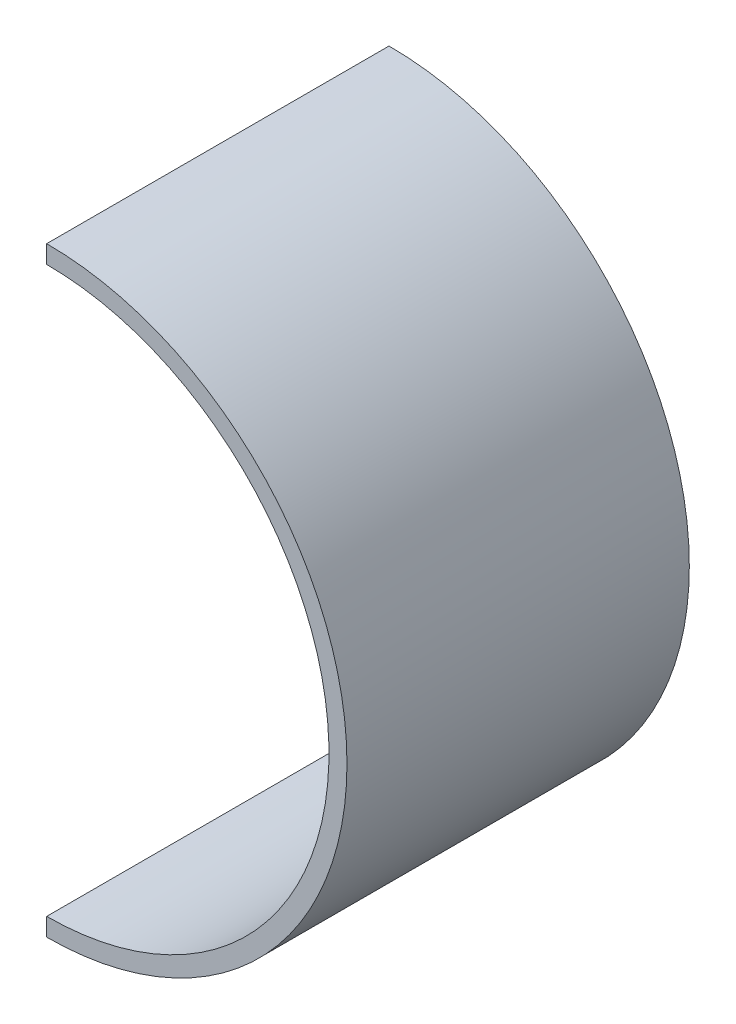
ISO-10303-21;
HEADER;
FILE_DESCRIPTION(('STEP AP214'),'2;1');
FILE_NAME('part.step','',(''),(''),'','','');
FILE_SCHEMA(('AUTOMOTIVE_DESIGN { 1 0 10303 214 1 1 1 1 }'));
ENDSEC;
DATA;
#1=APPLICATION_CONTEXT('core data for automotive mechanical design processes');
#2=APPLICATION_PROTOCOL_DEFINITION('international standard','automotive_design',2000,#1);
#3=PRODUCT_CONTEXT('',#1,'mechanical');
#4=PRODUCT('Part','Part','',(#3));
#5=PRODUCT_RELATED_PRODUCT_CATEGORY('part','',(#4));
#6=PRODUCT_DEFINITION_FORMATION('','',#4);
#7=PRODUCT_DEFINITION_CONTEXT('part definition',#1,'design');
#8=PRODUCT_DEFINITION('design','',#6,#7);
#9=PRODUCT_DEFINITION_SHAPE('','',#8);
#10=(LENGTH_UNIT() NAMED_UNIT(*) SI_UNIT(.MILLI.,.METRE.));
#11=(NAMED_UNIT(*) PLANE_ANGLE_UNIT() SI_UNIT($,.RADIAN.));
#12=(NAMED_UNIT(*) SI_UNIT($,.STERADIAN.) SOLID_ANGLE_UNIT());
#13=UNCERTAINTY_MEASURE_WITH_UNIT(LENGTH_MEASURE(1.E-05),#10,'distance_accuracy_value','');
#14=(GEOMETRIC_REPRESENTATION_CONTEXT(3) GLOBAL_UNCERTAINTY_ASSIGNED_CONTEXT((#13)) GLOBAL_UNIT_ASSIGNED_CONTEXT((#10,
#11,#12)) REPRESENTATION_CONTEXT('',''));
#15=CARTESIAN_POINT('',(0.,0.,0.));
#16=DIRECTION('',(0.,0.,1.));
#17=DIRECTION('',(1.,0.,0.));
#18=AXIS2_PLACEMENT_3D('',#15,#16,#17);
#19=CARTESIAN_POINT('',(-300.,0.,60.));
#20=DIRECTION('',(0.,0.,1.));
#21=DIRECTION('',(1.,0.,0.));
#22=AXIS2_PLACEMENT_3D('',#19,#20,#21);
#23=PLANE('',#22);
#24=CARTESIAN_POINT('',(300.,0.,60.));
#25=DIRECTION('',(0.,0.,1.));
#26=DIRECTION('',(1.,0.,0.));
#27=AXIS2_PLACEMENT_3D('',#24,#25,#26);
#28=CIRCLE('',#27,50.);
#29=CARTESIAN_POINT('',(300.,-50.,60.));
#30=VERTEX_POINT('',#29);
#31=CARTESIAN_POINT('',(300.,50.,60.));
#32=VERTEX_POINT('',#31);
#33=EDGE_CURVE('E91',#30,#32,#28,.T.);
#34=ORIENTED_EDGE('',*,*,#33,.T.);
#35=DIRECTION('',(0.,-1.,0.));
#36=VECTOR('',#35,1.);
#37=CARTESIAN_POINT('',(300.,3.43367945760358E-13,60.));
#38=LINE('',#37,#36);
#39=CARTESIAN_POINT('',(300.,47.,60.));
#40=VERTEX_POINT('',#39);
#41=EDGE_CURVE('E76',#32,#40,#38,.T.);
#42=ORIENTED_EDGE('',*,*,#41,.T.);
#43=CARTESIAN_POINT('',(300.,0.,60.));
#44=DIRECTION('',(0.,0.,1.));
#45=DIRECTION('',(1.,0.,0.));
#46=AXIS2_PLACEMENT_3D('',#43,#44,#45);
#47=CIRCLE('',#46,47.);
#48=CARTESIAN_POINT('',(300.,-47.,60.));
#49=VERTEX_POINT('',#48);
#50=EDGE_CURVE('E81',#49,#40,#47,.T.);
#51=ORIENTED_EDGE('',*,*,#50,.F.);
#52=EDGE_CURVE('E92',#49,#30,#38,.T.);
#53=ORIENTED_EDGE('',*,*,#52,.T.);
#54=EDGE_LOOP('',(#34,#42,#51,#53));
#55=FACE_BOUND('',#54,.T.);
#56=ADVANCED_FACE('F32',(#55),#23,.T.);
#57=CARTESIAN_POINT('',(0.,0.,3.));
#58=DIRECTION('',(0.,0.,1.));
#59=DIRECTION('',(1.,0.,0.));
#60=AXIS2_PLACEMENT_3D('',#57,#58,#59);
#61=PLANE('',#60);
#62=DIRECTION('',(0.,1.,0.));
#63=VECTOR('',#62,1.);
#64=CARTESIAN_POINT('',(300.,1.71683972880179E-13,3.));
#65=LINE('',#64,#63);
#66=CARTESIAN_POINT('',(300.,47.,3.));
#67=VERTEX_POINT('',#66);
#68=CARTESIAN_POINT('',(300.,50.,3.));
#69=VERTEX_POINT('',#68);
#70=EDGE_CURVE('E41',#67,#69,#65,.T.);
#71=ORIENTED_EDGE('',*,*,#70,.T.);
#72=CARTESIAN_POINT('',(300.,0.,3.));
#73=DIRECTION('',(0.,0.,1.));
#74=DIRECTION('',(1.,0.,0.));
#75=AXIS2_PLACEMENT_3D('',#72,#73,#74);
#76=CIRCLE('',#75,50.);
#77=CARTESIAN_POINT('',(300.,-50.,3.));
#78=VERTEX_POINT('',#77);
#79=EDGE_CURVE('E88',#78,#69,#76,.T.);
#80=ORIENTED_EDGE('',*,*,#79,.F.);
#81=DIRECTION('',(0.,1.,0.));
#82=VECTOR('',#81,1.);
#83=CARTESIAN_POINT('',(300.,1.71683972880179E-13,3.));
#84=LINE('',#83,#82);
#85=CARTESIAN_POINT('',(300.,-47.,3.));
#86=VERTEX_POINT('',#85);
#87=EDGE_CURVE('E11',#78,#86,#84,.T.);
#88=ORIENTED_EDGE('',*,*,#87,.T.);
#89=CARTESIAN_POINT('',(300.,0.,3.));
#90=DIRECTION('',(0.,0.,1.));
#91=DIRECTION('',(1.,0.,0.));
#92=AXIS2_PLACEMENT_3D('',#89,#90,#91);
#93=CIRCLE('',#92,47.);
#94=EDGE_CURVE('E36',#67,#86,#93,.F.);
#95=ORIENTED_EDGE('',*,*,#94,.F.);
#96=EDGE_LOOP('',(#71,#80,#88,#95));
#97=FACE_BOUND('',#96,.T.);
#98=ADVANCED_FACE('F34',(#97),#61,.F.);
#99=CARTESIAN_POINT('',(300.,0.,3.));
#100=DIRECTION('',(0.,0.,1.));
#101=DIRECTION('',(1.,0.,0.));
#102=AXIS2_PLACEMENT_3D('',#99,#100,#101);
#103=CYLINDRICAL_SURFACE('',#102,47.);
#104=DIRECTION('',(0.,0.,1.));
#105=VECTOR('',#104,1.);
#106=CARTESIAN_POINT('',(300.,47.,3.));
#107=LINE('',#106,#105);
#108=EDGE_CURVE('E71',#67,#40,#107,.T.);
#109=ORIENTED_EDGE('',*,*,#108,.F.);
#110=ORIENTED_EDGE('',*,*,#94,.T.);
#111=DIRECTION('',(0.,0.,1.));
#112=VECTOR('',#111,1.);
#113=CARTESIAN_POINT('',(300.,-47.,3.));
#114=LINE('',#113,#112);
#115=EDGE_CURVE('E84',#86,#49,#114,.T.);
#116=ORIENTED_EDGE('',*,*,#115,.T.);
#117=ORIENTED_EDGE('',*,*,#50,.T.);
#118=EDGE_LOOP('',(#109,#110,#116,#117));
#119=FACE_BOUND('',#118,.T.);
#120=ADVANCED_FACE('F82',(#119),#103,.F.);
#121=CARTESIAN_POINT('',(300.,0.,60.));
#122=DIRECTION('',(0.,0.,-1.));
#123=DIRECTION('',(-1.,0.,0.));
#124=AXIS2_PLACEMENT_3D('',#121,#122,#123);
#125=CYLINDRICAL_SURFACE('',#124,50.);
#126=DIRECTION('',(0.,0.,-1.));
#127=VECTOR('',#126,1.);
#128=CARTESIAN_POINT('',(300.,-50.,60.));
#129=LINE('',#128,#127);
#130=EDGE_CURVE('E94',#30,#78,#129,.T.);
#131=ORIENTED_EDGE('',*,*,#130,.T.);
#132=ORIENTED_EDGE('',*,*,#79,.T.);
#133=DIRECTION('',(0.,0.,-1.));
#134=VECTOR('',#133,1.);
#135=CARTESIAN_POINT('',(300.,50.,60.));
#136=LINE('',#135,#134);
#137=EDGE_CURVE('E78',#32,#69,#136,.T.);
#138=ORIENTED_EDGE('',*,*,#137,.F.);
#139=ORIENTED_EDGE('',*,*,#33,.F.);
#140=EDGE_LOOP('',(#131,#132,#138,#139));
#141=FACE_BOUND('',#140,.T.);
#142=ADVANCED_FACE('F100',(#141),#125,.T.);
#143=CARTESIAN_POINT('',(300.,1.71683972880179E-13,0.));
#144=DIRECTION('',(-1.,0.,0.));
#145=DIRECTION('',(0.,-1.,0.));
#146=AXIS2_PLACEMENT_3D('',#143,#144,#145);
#147=PLANE('',#146);
#148=ORIENTED_EDGE('',*,*,#70,.F.);
#149=ORIENTED_EDGE('',*,*,#108,.T.);
#150=ORIENTED_EDGE('',*,*,#41,.F.);
#151=ORIENTED_EDGE('',*,*,#137,.T.);
#152=EDGE_LOOP('',(#148,#149,#150,#151));
#153=FACE_BOUND('',#152,.T.);
#154=ADVANCED_FACE('F73',(#153),#147,.T.);
#155=ORIENTED_EDGE('',*,*,#87,.F.);
#156=ORIENTED_EDGE('',*,*,#130,.F.);
#157=ORIENTED_EDGE('',*,*,#52,.F.);
#158=ORIENTED_EDGE('',*,*,#115,.F.);
#159=EDGE_LOOP('',(#155,#156,#157,#158));
#160=FACE_BOUND('',#159,.T.);
#161=ADVANCED_FACE('F105',(#160),#147,.T.);
#162=CLOSED_SHELL('',(#56,#98,#120,#142,#154,#161));
#163=MANIFOLD_SOLID_BREP('B2',#162);
#164=ADVANCED_BREP_SHAPE_REPRESENTATION('',(#18,#163),#14);
#165=SHAPE_DEFINITION_REPRESENTATION(#9,#164);
ENDSEC;
END-ISO-10303-21;
